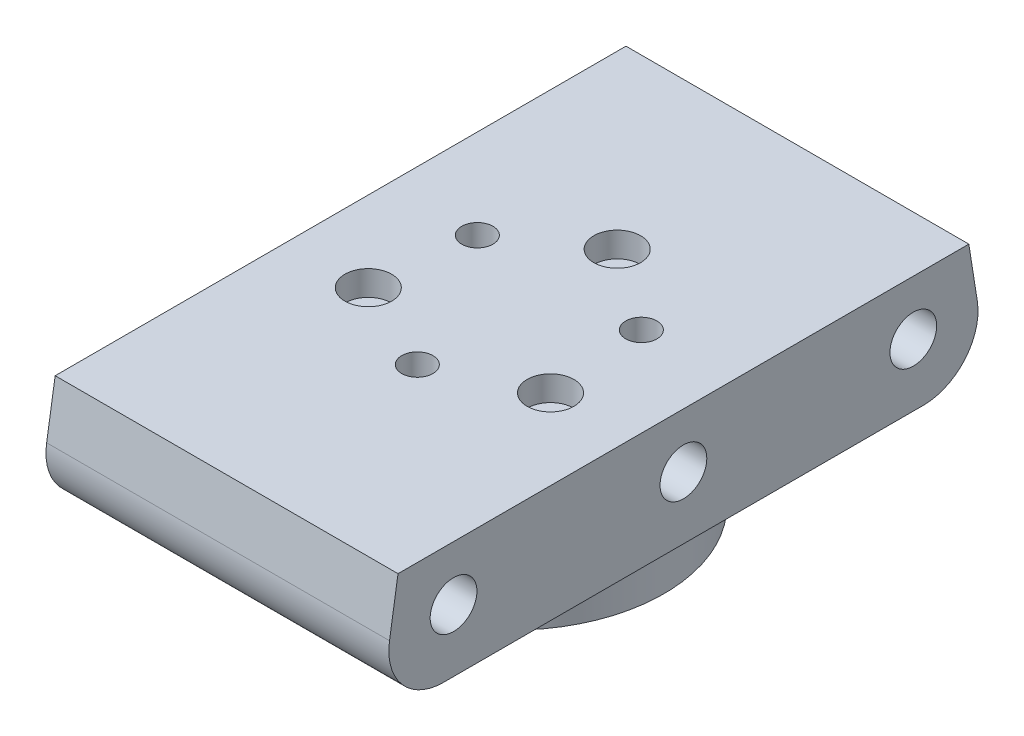
ISO-10303-21;
HEADER;
FILE_DESCRIPTION(('STEP AP214'),'2;1');
FILE_NAME('part.step','',(''),(''),'','','');
FILE_SCHEMA(('AUTOMOTIVE_DESIGN { 1 0 10303 214 1 1 1 1 }'));
ENDSEC;
DATA;
#1=APPLICATION_CONTEXT('core data for automotive mechanical design processes');
#2=APPLICATION_PROTOCOL_DEFINITION('international standard','automotive_design',2000,#1);
#3=PRODUCT_CONTEXT('',#1,'mechanical');
#4=PRODUCT('Part','Part','',(#3));
#5=PRODUCT_RELATED_PRODUCT_CATEGORY('part','',(#4));
#6=PRODUCT_DEFINITION_FORMATION('','',#4);
#7=PRODUCT_DEFINITION_CONTEXT('part definition',#1,'design');
#8=PRODUCT_DEFINITION('design','',#6,#7);
#9=PRODUCT_DEFINITION_SHAPE('','',#8);
#10=(LENGTH_UNIT() NAMED_UNIT(*) SI_UNIT(.MILLI.,.METRE.));
#11=(NAMED_UNIT(*) PLANE_ANGLE_UNIT() SI_UNIT($,.RADIAN.));
#12=(NAMED_UNIT(*) SI_UNIT($,.STERADIAN.) SOLID_ANGLE_UNIT());
#13=UNCERTAINTY_MEASURE_WITH_UNIT(LENGTH_MEASURE(1.E-05),#10,'distance_accuracy_value','');
#14=(GEOMETRIC_REPRESENTATION_CONTEXT(3) GLOBAL_UNCERTAINTY_ASSIGNED_CONTEXT((#13)) GLOBAL_UNIT_ASSIGNED_CONTEXT((#10,
#11,#12)) REPRESENTATION_CONTEXT('',''));
#15=CARTESIAN_POINT('',(0.,0.,0.));
#16=DIRECTION('',(0.,0.,1.));
#17=DIRECTION('',(1.,0.,0.));
#18=AXIS2_PLACEMENT_3D('',#15,#16,#17);
#19=CARTESIAN_POINT('',(0.,6.8,-13.5));
#20=DIRECTION('',(0.,-1.,0.));
#21=DIRECTION('',(0.,0.,-1.));
#22=AXIS2_PLACEMENT_3D('',#19,#20,#21);
#23=CYLINDRICAL_SURFACE('',#22,1.5);
#24=CARTESIAN_POINT('',(0.,0.,-13.5));
#25=DIRECTION('',(0.,1.,0.));
#26=DIRECTION('',(0.,0.,1.));
#27=AXIS2_PLACEMENT_3D('',#24,#25,#26);
#28=CIRCLE('',#27,1.5);
#29=CARTESIAN_POINT('',(0.,0.,-12.));
#30=VERTEX_POINT('',#29);
#31=EDGE_CURVE('E158',#30,#30,#28,.T.);
#32=ORIENTED_EDGE('',*,*,#31,.F.);
#33=EDGE_LOOP('',(#32));
#34=FACE_BOUND('',#33,.T.);
#35=CARTESIAN_POINT('',(0.,18.6,-13.5));
#36=DIRECTION('',(0.,1.,0.));
#37=DIRECTION('',(0.,0.,1.));
#38=AXIS2_PLACEMENT_3D('',#35,#36,#37);
#39=CIRCLE('',#38,1.5);
#40=CARTESIAN_POINT('',(0.,18.6,-12.));
#41=VERTEX_POINT('',#40);
#42=EDGE_CURVE('E41',#41,#41,#39,.T.);
#43=ORIENTED_EDGE('',*,*,#42,.T.);
#44=EDGE_LOOP('',(#43));
#45=FACE_BOUND('',#44,.T.);
#46=ADVANCED_FACE('F37',(#34,#45),#23,.F.);
#47=CARTESIAN_POINT('',(11.6913429510899,6.8,6.75));
#48=DIRECTION('',(0.,-1.,0.));
#49=DIRECTION('',(0.,0.,-1.));
#50=AXIS2_PLACEMENT_3D('',#47,#48,#49);
#51=CYLINDRICAL_SURFACE('',#50,1.5);
#52=CARTESIAN_POINT('',(11.6913429510899,0.,6.75));
#53=DIRECTION('',(0.,1.,0.));
#54=DIRECTION('',(0.,0.,1.));
#55=AXIS2_PLACEMENT_3D('',#52,#53,#54);
#56=CIRCLE('',#55,1.5);
#57=CARTESIAN_POINT('',(11.6913429510899,0.,8.25));
#58=VERTEX_POINT('',#57);
#59=EDGE_CURVE('E155',#58,#58,#56,.T.);
#60=ORIENTED_EDGE('',*,*,#59,.F.);
#61=EDGE_LOOP('',(#60));
#62=FACE_BOUND('',#61,.T.);
#63=CARTESIAN_POINT('',(11.6913429510899,18.6,6.75));
#64=DIRECTION('',(0.,1.,0.));
#65=DIRECTION('',(0.,0.,1.));
#66=AXIS2_PLACEMENT_3D('',#63,#64,#65);
#67=CIRCLE('',#66,1.5);
#68=CARTESIAN_POINT('',(11.6913429510899,18.6,8.25));
#69=VERTEX_POINT('',#68);
#70=EDGE_CURVE('E192',#69,#69,#67,.T.);
#71=ORIENTED_EDGE('',*,*,#70,.T.);
#72=EDGE_LOOP('',(#71));
#73=FACE_BOUND('',#72,.T.);
#74=ADVANCED_FACE('F249',(#62,#73),#51,.F.);
#75=CARTESIAN_POINT('',(-11.6913429510899,6.8,6.75));
#76=DIRECTION('',(0.,-1.,0.));
#77=DIRECTION('',(0.,0.,-1.));
#78=AXIS2_PLACEMENT_3D('',#75,#76,#77);
#79=CYLINDRICAL_SURFACE('',#78,1.5);
#80=CARTESIAN_POINT('',(-11.6913429510899,0.,6.75));
#81=DIRECTION('',(0.,1.,0.));
#82=DIRECTION('',(0.,0.,1.));
#83=AXIS2_PLACEMENT_3D('',#80,#81,#82);
#84=CIRCLE('',#83,1.5);
#85=CARTESIAN_POINT('',(-11.6913429510899,0.,8.25));
#86=VERTEX_POINT('',#85);
#87=EDGE_CURVE('E152',#86,#86,#84,.T.);
#88=ORIENTED_EDGE('',*,*,#87,.F.);
#89=EDGE_LOOP('',(#88));
#90=FACE_BOUND('',#89,.T.);
#91=CARTESIAN_POINT('',(-11.6913429510899,18.6,6.75));
#92=DIRECTION('',(0.,1.,0.));
#93=DIRECTION('',(0.,0.,1.));
#94=AXIS2_PLACEMENT_3D('',#91,#92,#93);
#95=CIRCLE('',#94,1.5);
#96=CARTESIAN_POINT('',(-11.6913429510899,18.6,8.25));
#97=VERTEX_POINT('',#96);
#98=EDGE_CURVE('E190',#97,#97,#95,.T.);
#99=ORIENTED_EDGE('',*,*,#98,.T.);
#100=EDGE_LOOP('',(#99));
#101=FACE_BOUND('',#100,.T.);
#102=ADVANCED_FACE('F255',(#90,#101),#79,.F.);
#103=CARTESIAN_POINT('',(0.,0.,0.));
#104=DIRECTION('',(0.,1.,0.));
#105=DIRECTION('',(0.,0.,1.));
#106=AXIS2_PLACEMENT_3D('',#103,#104,#105);
#107=PLANE('',#106);
#108=CARTESIAN_POINT('',(0.,0.,0.));
#109=DIRECTION('',(0.,1.,0.));
#110=DIRECTION('',(0.,0.,1.));
#111=AXIS2_PLACEMENT_3D('',#108,#109,#110);
#112=CIRCLE('',#111,19.5);
#113=CARTESIAN_POINT('',(0.,0.,19.5));
#114=VERTEX_POINT('',#113);
#115=EDGE_CURVE('E170',#114,#114,#112,.T.);
#116=ORIENTED_EDGE('',*,*,#115,.F.);
#117=EDGE_LOOP('',(#116));
#118=FACE_BOUND('',#117,.T.);
#119=CARTESIAN_POINT('',(-10.5222086559809,0.,-6.075));
#120=DIRECTION('',(0.,1.,0.));
#121=DIRECTION('',(0.,0.,1.));
#122=AXIS2_PLACEMENT_3D('',#119,#120,#121);
#123=CIRCLE('',#122,2.);
#124=CARTESIAN_POINT('',(-10.5222086559809,0.,-4.075));
#125=VERTEX_POINT('',#124);
#126=EDGE_CURVE('E167',#125,#125,#123,.T.);
#127=ORIENTED_EDGE('',*,*,#126,.T.);
#128=EDGE_LOOP('',(#127));
#129=FACE_BOUND('',#128,.T.);
#130=CARTESIAN_POINT('',(0.,0.,12.15));
#131=DIRECTION('',(0.,1.,0.));
#132=DIRECTION('',(0.,0.,1.));
#133=AXIS2_PLACEMENT_3D('',#130,#131,#132);
#134=CIRCLE('',#133,2.);
#135=CARTESIAN_POINT('',(0.,0.,14.15));
#136=VERTEX_POINT('',#135);
#137=EDGE_CURVE('E164',#136,#136,#134,.T.);
#138=ORIENTED_EDGE('',*,*,#137,.T.);
#139=EDGE_LOOP('',(#138));
#140=FACE_BOUND('',#139,.T.);
#141=CARTESIAN_POINT('',(10.5222086559809,0.,-6.075));
#142=DIRECTION('',(0.,1.,0.));
#143=DIRECTION('',(0.,0.,1.));
#144=AXIS2_PLACEMENT_3D('',#141,#142,#143);
#145=CIRCLE('',#144,2.);
#146=CARTESIAN_POINT('',(10.5222086559809,0.,-4.075));
#147=VERTEX_POINT('',#146);
#148=EDGE_CURVE('E161',#147,#147,#145,.T.);
#149=ORIENTED_EDGE('',*,*,#148,.T.);
#150=EDGE_LOOP('',(#149));
#151=FACE_BOUND('',#150,.T.);
#152=ORIENTED_EDGE('',*,*,#31,.T.);
#153=EDGE_LOOP('',(#152));
#154=FACE_BOUND('',#153,.T.);
#155=ORIENTED_EDGE('',*,*,#59,.T.);
#156=EDGE_LOOP('',(#155));
#157=FACE_BOUND('',#156,.T.);
#158=ORIENTED_EDGE('',*,*,#87,.T.);
#159=EDGE_LOOP('',(#158));
#160=FACE_BOUND('',#159,.T.);
#161=ADVANCED_FACE('F273',(#118,#129,#140,#151,#154,#157,#160),#107,.F.);
#162=CARTESIAN_POINT('',(0.,6.8,0.));
#163=DIRECTION('',(0.,-1.,0.));
#164=DIRECTION('',(0.,0.,-1.));
#165=AXIS2_PLACEMENT_3D('',#162,#163,#164);
#166=CYLINDRICAL_SURFACE('',#165,19.5);
#167=CARTESIAN_POINT('',(0.,4.80000000000001,0.));
#168=DIRECTION('',(0.,1.,0.));
#169=DIRECTION('',(0.,0.,1.));
#170=AXIS2_PLACEMENT_3D('',#167,#168,#169);
#171=CIRCLE('',#170,19.5);
#172=CARTESIAN_POINT('',(0.,4.80000000000001,19.5));
#173=VERTEX_POINT('',#172);
#174=EDGE_CURVE('E176',#173,#173,#171,.F.);
#175=ORIENTED_EDGE('',*,*,#174,.T.);
#176=EDGE_LOOP('',(#175));
#177=FACE_BOUND('',#176,.T.);
#178=ORIENTED_EDGE('',*,*,#115,.T.);
#179=EDGE_LOOP('',(#178));
#180=FACE_BOUND('',#179,.T.);
#181=ADVANCED_FACE('F271',(#177,#180),#166,.T.);
#182=CARTESIAN_POINT('',(-10.5222086559809,6.8,-6.075));
#183=DIRECTION('',(0.,-1.,0.));
#184=DIRECTION('',(0.,0.,-1.));
#185=AXIS2_PLACEMENT_3D('',#182,#183,#184);
#186=CYLINDRICAL_SURFACE('',#185,2.);
#187=ORIENTED_EDGE('',*,*,#126,.F.);
#188=EDGE_LOOP('',(#187));
#189=FACE_BOUND('',#188,.T.);
#190=CARTESIAN_POINT('',(-10.5222086559809,21.8,-6.075));
#191=DIRECTION('',(0.,1.,0.));
#192=DIRECTION('',(0.,0.,1.));
#193=AXIS2_PLACEMENT_3D('',#190,#191,#192);
#194=CIRCLE('',#193,2.);
#195=CARTESIAN_POINT('',(-10.5222086559809,21.8,-4.075));
#196=VERTEX_POINT('',#195);
#197=EDGE_CURVE('E198',#196,#196,#194,.T.);
#198=ORIENTED_EDGE('',*,*,#197,.T.);
#199=EDGE_LOOP('',(#198));
#200=FACE_BOUND('',#199,.T.);
#201=ADVANCED_FACE('F267',(#189,#200),#186,.F.);
#202=CARTESIAN_POINT('',(0.,6.8,12.15));
#203=DIRECTION('',(0.,-1.,0.));
#204=DIRECTION('',(0.,0.,-1.));
#205=AXIS2_PLACEMENT_3D('',#202,#203,#204);
#206=CYLINDRICAL_SURFACE('',#205,2.);
#207=ORIENTED_EDGE('',*,*,#137,.F.);
#208=EDGE_LOOP('',(#207));
#209=FACE_BOUND('',#208,.T.);
#210=CARTESIAN_POINT('',(0.,21.8,12.15));
#211=DIRECTION('',(0.,1.,0.));
#212=DIRECTION('',(0.,0.,1.));
#213=AXIS2_PLACEMENT_3D('',#210,#211,#212);
#214=CIRCLE('',#213,2.);
#215=CARTESIAN_POINT('',(0.,21.8,14.15));
#216=VERTEX_POINT('',#215);
#217=EDGE_CURVE('E202',#216,#216,#214,.T.);
#218=ORIENTED_EDGE('',*,*,#217,.T.);
#219=EDGE_LOOP('',(#218));
#220=FACE_BOUND('',#219,.T.);
#221=ADVANCED_FACE('F263',(#209,#220),#206,.F.);
#222=CARTESIAN_POINT('',(10.5222086559809,6.8,-6.075));
#223=DIRECTION('',(0.,-1.,0.));
#224=DIRECTION('',(0.,0.,-1.));
#225=AXIS2_PLACEMENT_3D('',#222,#223,#224);
#226=CYLINDRICAL_SURFACE('',#225,2.);
#227=ORIENTED_EDGE('',*,*,#148,.F.);
#228=EDGE_LOOP('',(#227));
#229=FACE_BOUND('',#228,.T.);
#230=CARTESIAN_POINT('',(10.5222086559809,21.8,-6.075));
#231=DIRECTION('',(0.,1.,0.));
#232=DIRECTION('',(0.,0.,1.));
#233=AXIS2_PLACEMENT_3D('',#230,#231,#232);
#234=CIRCLE('',#233,2.);
#235=CARTESIAN_POINT('',(10.5222086559809,21.8,-4.075));
#236=VERTEX_POINT('',#235);
#237=EDGE_CURVE('E207',#236,#236,#234,.T.);
#238=ORIENTED_EDGE('',*,*,#237,.T.);
#239=EDGE_LOOP('',(#238));
#240=FACE_BOUND('',#239,.T.);
#241=ADVANCED_FACE('F243',(#229,#240),#226,.F.);
#242=CARTESIAN_POINT('',(0.,6.8,0.));
#243=DIRECTION('',(0.,1.,0.));
#244=DIRECTION('',(0.,0.,1.));
#245=AXIS2_PLACEMENT_3D('',#242,#243,#244);
#246=PLANE('',#245);
#247=CARTESIAN_POINT('',(0.,6.8,0.));
#248=DIRECTION('',(0.,1.,0.));
#249=DIRECTION('',(0.,0.,1.));
#250=AXIS2_PLACEMENT_3D('',#247,#248,#249);
#251=CIRCLE('',#250,21.5);
#252=CARTESIAN_POINT('',(0.,6.8,21.5));
#253=VERTEX_POINT('',#252);
#254=EDGE_CURVE('E173',#253,#253,#251,.T.);
#255=ORIENTED_EDGE('',*,*,#254,.T.);
#256=EDGE_LOOP('',(#255));
#257=FACE_BOUND('',#256,.T.);
#258=DIRECTION('',(0.,0.,1.));
#259=VECTOR('',#258,1.);
#260=CARTESIAN_POINT('',(-22.,6.8,-39.));
#261=LINE('',#260,#259);
#262=CARTESIAN_POINT('',(-22.,6.8,-30.8054963273457));
#263=VERTEX_POINT('',#262);
#264=CARTESIAN_POINT('',(-22.,6.8,30.8054963273457));
#265=VERTEX_POINT('',#264);
#266=EDGE_CURVE('E150',#263,#265,#261,.T.);
#267=ORIENTED_EDGE('',*,*,#266,.F.);
#268=DIRECTION('',(-1.,0.,0.));
#269=VECTOR('',#268,1.);
#270=CARTESIAN_POINT('',(0.,6.8,-30.8054963273457));
#271=LINE('',#270,#269);
#272=CARTESIAN_POINT('',(22.,6.8,-30.8054963273457));
#273=VERTEX_POINT('',#272);
#274=EDGE_CURVE('E61',#263,#273,#271,.F.);
#275=ORIENTED_EDGE('',*,*,#274,.T.);
#276=DIRECTION('',(0.,0.,-1.));
#277=VECTOR('',#276,1.);
#278=CARTESIAN_POINT('',(22.,6.8,-39.));
#279=LINE('',#278,#277);
#280=CARTESIAN_POINT('',(22.,6.8,30.8054963273457));
#281=VERTEX_POINT('',#280);
#282=EDGE_CURVE('E113',#281,#273,#279,.T.);
#283=ORIENTED_EDGE('',*,*,#282,.F.);
#284=DIRECTION('',(1.,0.,0.));
#285=VECTOR('',#284,1.);
#286=CARTESIAN_POINT('',(0.,6.8,30.8054963273457));
#287=LINE('',#286,#285);
#288=EDGE_CURVE('E185',#281,#265,#287,.F.);
#289=ORIENTED_EDGE('',*,*,#288,.T.);
#290=EDGE_LOOP('',(#267,#275,#283,#289));
#291=FACE_BOUND('',#290,.T.);
#292=ADVANCED_FACE('F234',(#257,#291),#246,.F.);
#293=CARTESIAN_POINT('',(-22.,76.8,-39.));
#294=DIRECTION('',(1.,0.,0.));
#295=DIRECTION('',(0.,0.,-1.));
#296=AXIS2_PLACEMENT_3D('',#293,#294,#295);
#297=PLANE('',#296);
#298=CARTESIAN_POINT('',(-22.,14.8,-29.5));
#299=DIRECTION('',(-1.,0.,0.));
#300=DIRECTION('',(0.,0.,1.));
#301=AXIS2_PLACEMENT_3D('',#298,#299,#300);
#302=CIRCLE('',#301,3.);
#303=CARTESIAN_POINT('',(-22.,14.8,-26.5));
#304=VERTEX_POINT('',#303);
#305=EDGE_CURVE('E216',#304,#304,#302,.T.);
#306=ORIENTED_EDGE('',*,*,#305,.F.);
#307=EDGE_LOOP('',(#306));
#308=FACE_BOUND('',#307,.T.);
#309=CARTESIAN_POINT('',(-22.,14.8,0.));
#310=DIRECTION('',(-1.,0.,0.));
#311=DIRECTION('',(0.,0.,1.));
#312=AXIS2_PLACEMENT_3D('',#309,#310,#311);
#313=CIRCLE('',#312,3.);
#314=CARTESIAN_POINT('',(-22.,14.8,3.));
#315=VERTEX_POINT('',#314);
#316=EDGE_CURVE('E222',#315,#315,#313,.T.);
#317=ORIENTED_EDGE('',*,*,#316,.F.);
#318=EDGE_LOOP('',(#317));
#319=FACE_BOUND('',#318,.T.);
#320=CARTESIAN_POINT('',(-22.,14.8,29.5));
#321=DIRECTION('',(-1.,0.,0.));
#322=DIRECTION('',(0.,0.,1.));
#323=AXIS2_PLACEMENT_3D('',#320,#321,#322);
#324=CIRCLE('',#323,3.);
#325=CARTESIAN_POINT('',(-22.,14.8,32.5));
#326=VERTEX_POINT('',#325);
#327=EDGE_CURVE('E213',#326,#326,#324,.T.);
#328=ORIENTED_EDGE('',*,*,#327,.F.);
#329=EDGE_LOOP('',(#328));
#330=FACE_BOUND('',#329,.T.);
#331=DIRECTION('',(0.,-0.987715537065377,-0.156262656574285));
#332=VECTOR('',#331,1.);
#333=CARTESIAN_POINT('',(-22.,21.8,-36.6269079905553));
#334=LINE('',#333,#332);
#335=CARTESIAN_POINT('',(-22.,21.8,-36.6269079905553));
#336=VERTEX_POINT('',#335);
#337=CARTESIAN_POINT('',(-22.,14.89383859602,-37.7195050868033));
#338=VERTEX_POINT('',#337);
#339=EDGE_CURVE('E119',#336,#338,#334,.T.);
#340=ORIENTED_EDGE('',*,*,#339,.T.);
#341=CARTESIAN_POINT('',(-22.,13.8,-30.8054963273457));
#342=DIRECTION('',(1.,0.,0.));
#343=DIRECTION('',(0.,0.,-1.));
#344=AXIS2_PLACEMENT_3D('',#341,#342,#343);
#345=CIRCLE('',#344,7.);
#346=EDGE_CURVE('E183',#338,#263,#345,.F.);
#347=ORIENTED_EDGE('',*,*,#346,.T.);
#348=ORIENTED_EDGE('',*,*,#266,.T.);
#349=CARTESIAN_POINT('',(-22.,13.8,30.8054963273457));
#350=DIRECTION('',(1.,0.,0.));
#351=DIRECTION('',(0.,0.,-1.));
#352=AXIS2_PLACEMENT_3D('',#349,#350,#351);
#353=CIRCLE('',#352,7.);
#354=CARTESIAN_POINT('',(-22.,14.89383859602,37.7195050868033));
#355=VERTEX_POINT('',#354);
#356=EDGE_CURVE('E102',#265,#355,#353,.F.);
#357=ORIENTED_EDGE('',*,*,#356,.T.);
#358=DIRECTION('',(0.,0.987715537065378,-0.156262656574284));
#359=VECTOR('',#358,1.);
#360=CARTESIAN_POINT('',(-22.,6.8,39.));
#361=LINE('',#360,#359);
#362=CARTESIAN_POINT('',(-22.,21.8,36.6269079905553));
#363=VERTEX_POINT('',#362);
#364=EDGE_CURVE('E94',#355,#363,#361,.T.);
#365=ORIENTED_EDGE('',*,*,#364,.T.);
#366=DIRECTION('',(0.,0.,-1.));
#367=VECTOR('',#366,1.);
#368=CARTESIAN_POINT('',(-22.,21.8,36.6269079905553));
#369=LINE('',#368,#367);
#370=EDGE_CURVE('E99',#363,#336,#369,.T.);
#371=ORIENTED_EDGE('',*,*,#370,.T.);
#372=EDGE_LOOP('',(#340,#347,#348,#357,#365,#371));
#373=FACE_BOUND('',#372,.T.);
#374=ADVANCED_FACE('F97',(#308,#319,#330,#373),#297,.F.);
#375=CARTESIAN_POINT('',(22.,76.8,-39.));
#376=DIRECTION('',(-1.,0.,0.));
#377=DIRECTION('',(0.,0.,1.));
#378=AXIS2_PLACEMENT_3D('',#375,#376,#377);
#379=PLANE('',#378);
#380=CARTESIAN_POINT('',(22.,14.8,-29.5));
#381=DIRECTION('',(1.,0.,0.));
#382=DIRECTION('',(0.,0.,1.));
#383=AXIS2_PLACEMENT_3D('',#380,#381,#382);
#384=CIRCLE('',#383,3.);
#385=CARTESIAN_POINT('',(22.,14.8,-26.5));
#386=VERTEX_POINT('',#385);
#387=EDGE_CURVE('E121',#386,#386,#384,.T.);
#388=ORIENTED_EDGE('',*,*,#387,.F.);
#389=EDGE_LOOP('',(#388));
#390=FACE_BOUND('',#389,.T.);
#391=CARTESIAN_POINT('',(22.,14.8,29.5));
#392=DIRECTION('',(1.,0.,0.));
#393=DIRECTION('',(0.,0.,-1.));
#394=AXIS2_PLACEMENT_3D('',#391,#392,#393);
#395=CIRCLE('',#394,3.);
#396=CARTESIAN_POINT('',(22.,14.8,26.5));
#397=VERTEX_POINT('',#396);
#398=EDGE_CURVE('E135',#397,#397,#395,.T.);
#399=ORIENTED_EDGE('',*,*,#398,.F.);
#400=EDGE_LOOP('',(#399));
#401=FACE_BOUND('',#400,.T.);
#402=CARTESIAN_POINT('',(22.,14.8,0.));
#403=DIRECTION('',(1.,0.,0.));
#404=DIRECTION('',(0.,0.,-1.));
#405=AXIS2_PLACEMENT_3D('',#402,#403,#404);
#406=CIRCLE('',#405,3.);
#407=CARTESIAN_POINT('',(22.,14.8,-3.00000000000001));
#408=VERTEX_POINT('',#407);
#409=EDGE_CURVE('E129',#408,#408,#406,.T.);
#410=ORIENTED_EDGE('',*,*,#409,.F.);
#411=EDGE_LOOP('',(#410));
#412=FACE_BOUND('',#411,.T.);
#413=ORIENTED_EDGE('',*,*,#282,.T.);
#414=CARTESIAN_POINT('',(22.,13.8,-30.8054963273457));
#415=DIRECTION('',(-1.,0.,0.));
#416=DIRECTION('',(0.,0.,1.));
#417=AXIS2_PLACEMENT_3D('',#414,#415,#416);
#418=CIRCLE('',#417,7.);
#419=CARTESIAN_POINT('',(22.,14.89383859602,-37.7195050868033));
#420=VERTEX_POINT('',#419);
#421=EDGE_CURVE('E46',#273,#420,#418,.F.);
#422=ORIENTED_EDGE('',*,*,#421,.T.);
#423=DIRECTION('',(0.,-0.987715537065377,-0.156262656574285));
#424=VECTOR('',#423,1.);
#425=CARTESIAN_POINT('',(22.,6.80000000000001,-39.));
#426=LINE('',#425,#424);
#427=CARTESIAN_POINT('',(22.,21.8,-36.6269079905553));
#428=VERTEX_POINT('',#427);
#429=EDGE_CURVE('E144',#428,#420,#426,.T.);
#430=ORIENTED_EDGE('',*,*,#429,.F.);
#431=DIRECTION('',(0.,0.,-1.));
#432=VECTOR('',#431,1.);
#433=CARTESIAN_POINT('',(22.,21.8,36.6269079905553));
#434=LINE('',#433,#432);
#435=CARTESIAN_POINT('',(22.,21.8,36.6269079905553));
#436=VERTEX_POINT('',#435);
#437=EDGE_CURVE('E128',#436,#428,#434,.T.);
#438=ORIENTED_EDGE('',*,*,#437,.F.);
#439=DIRECTION('',(0.,0.987715537065378,-0.156262656574284));
#440=VECTOR('',#439,1.);
#441=CARTESIAN_POINT('',(22.,6.8,39.));
#442=LINE('',#441,#440);
#443=CARTESIAN_POINT('',(22.,14.89383859602,37.7195050868033));
#444=VERTEX_POINT('',#443);
#445=EDGE_CURVE('E110',#444,#436,#442,.T.);
#446=ORIENTED_EDGE('',*,*,#445,.F.);
#447=CARTESIAN_POINT('',(22.,13.8,30.8054963273457));
#448=DIRECTION('',(-1.,0.,0.));
#449=DIRECTION('',(0.,0.,1.));
#450=AXIS2_PLACEMENT_3D('',#447,#448,#449);
#451=CIRCLE('',#450,7.);
#452=EDGE_CURVE('E54',#444,#281,#451,.F.);
#453=ORIENTED_EDGE('',*,*,#452,.T.);
#454=EDGE_LOOP('',(#413,#422,#430,#438,#446,#453));
#455=FACE_BOUND('',#454,.T.);
#456=ADVANCED_FACE('F233',(#390,#401,#412,#455),#379,.F.);
#457=CARTESIAN_POINT('',(10.,21.8,36.6269079905553));
#458=DIRECTION('',(0.,-1.,0.));
#459=DIRECTION('',(0.,0.,-1.));
#460=AXIS2_PLACEMENT_3D('',#457,#458,#459);
#461=PLANE('',#460);
#462=CARTESIAN_POINT('',(0.,21.8,-13.5));
#463=DIRECTION('',(0.,1.,0.));
#464=DIRECTION('',(0.,0.,1.));
#465=AXIS2_PLACEMENT_3D('',#462,#463,#464);
#466=CIRCLE('',#465,3.);
#467=CARTESIAN_POINT('',(0.,21.8,-10.5));
#468=VERTEX_POINT('',#467);
#469=EDGE_CURVE('E320',#468,#468,#466,.T.);
#470=ORIENTED_EDGE('',*,*,#469,.F.);
#471=EDGE_LOOP('',(#470));
#472=FACE_BOUND('',#471,.T.);
#473=CARTESIAN_POINT('',(11.6913429510899,21.8,6.75000000000001));
#474=DIRECTION('',(0.,1.,0.));
#475=DIRECTION('',(0.,0.,1.));
#476=AXIS2_PLACEMENT_3D('',#473,#474,#475);
#477=CIRCLE('',#476,3.);
#478=CARTESIAN_POINT('',(11.6913429510899,21.8,9.75000000000001));
#479=VERTEX_POINT('',#478);
#480=EDGE_CURVE('E324',#479,#479,#477,.T.);
#481=ORIENTED_EDGE('',*,*,#480,.F.);
#482=EDGE_LOOP('',(#481));
#483=FACE_BOUND('',#482,.T.);
#484=CARTESIAN_POINT('',(-11.6913429510899,21.8,6.75));
#485=DIRECTION('',(0.,1.,0.));
#486=DIRECTION('',(0.,0.,1.));
#487=AXIS2_PLACEMENT_3D('',#484,#485,#486);
#488=CIRCLE('',#487,3.);
#489=CARTESIAN_POINT('',(-11.6913429510899,21.8,9.75000000000001));
#490=VERTEX_POINT('',#489);
#491=EDGE_CURVE('E328',#490,#490,#488,.T.);
#492=ORIENTED_EDGE('',*,*,#491,.F.);
#493=EDGE_LOOP('',(#492));
#494=FACE_BOUND('',#493,.T.);
#495=ORIENTED_EDGE('',*,*,#197,.F.);
#496=EDGE_LOOP('',(#495));
#497=FACE_BOUND('',#496,.T.);
#498=ORIENTED_EDGE('',*,*,#217,.F.);
#499=EDGE_LOOP('',(#498));
#500=FACE_BOUND('',#499,.T.);
#501=ORIENTED_EDGE('',*,*,#237,.F.);
#502=EDGE_LOOP('',(#501));
#503=FACE_BOUND('',#502,.T.);
#504=ORIENTED_EDGE('',*,*,#437,.T.);
#505=DIRECTION('',(1.,0.,0.));
#506=VECTOR('',#505,1.);
#507=CARTESIAN_POINT('',(10.,21.8,-36.6269079905553));
#508=LINE('',#507,#506);
#509=EDGE_CURVE('E114',#336,#428,#508,.T.);
#510=ORIENTED_EDGE('',*,*,#509,.F.);
#511=ORIENTED_EDGE('',*,*,#370,.F.);
#512=DIRECTION('',(1.,0.,0.));
#513=VECTOR('',#512,1.);
#514=CARTESIAN_POINT('',(10.,21.8,36.6269079905553));
#515=LINE('',#514,#513);
#516=EDGE_CURVE('E107',#363,#436,#515,.T.);
#517=ORIENTED_EDGE('',*,*,#516,.T.);
#518=EDGE_LOOP('',(#504,#510,#511,#517));
#519=FACE_BOUND('',#518,.T.);
#520=ADVANCED_FACE('F116',(#472,#483,#494,#497,#500,#503,#519),#461,.F.);
#521=CARTESIAN_POINT('',(10.,6.8,39.));
#522=DIRECTION('',(0.,-0.156262656574284,-0.987715537065378));
#523=DIRECTION('',(0.,0.987715537065378,-0.156262656574284));
#524=AXIS2_PLACEMENT_3D('',#521,#522,#523);
#525=PLANE('',#524);
#526=ORIENTED_EDGE('',*,*,#364,.F.);
#527=DIRECTION('',(1.,0.,0.));
#528=VECTOR('',#527,1.);
#529=CARTESIAN_POINT('',(10.,14.89383859602,37.7195050868033));
#530=LINE('',#529,#528);
#531=EDGE_CURVE('E11',#355,#444,#530,.T.);
#532=ORIENTED_EDGE('',*,*,#531,.T.);
#533=ORIENTED_EDGE('',*,*,#445,.T.);
#534=ORIENTED_EDGE('',*,*,#516,.F.);
#535=EDGE_LOOP('',(#526,#532,#533,#534));
#536=FACE_BOUND('',#535,.T.);
#537=ADVANCED_FACE('F108',(#536),#525,.F.);
#538=CARTESIAN_POINT('',(10.,6.80000000000001,-39.));
#539=DIRECTION('',(0.,-0.156262656574285,0.987715537065378));
#540=DIRECTION('',(0.,-0.987715537065378,-0.156262656574285));
#541=AXIS2_PLACEMENT_3D('',#538,#539,#540);
#542=PLANE('',#541);
#543=ORIENTED_EDGE('',*,*,#429,.T.);
#544=DIRECTION('',(-1.,0.,0.));
#545=VECTOR('',#544,1.);
#546=CARTESIAN_POINT('',(10.,14.89383859602,-37.7195050868033));
#547=LINE('',#546,#545);
#548=EDGE_CURVE('E179',#420,#338,#547,.T.);
#549=ORIENTED_EDGE('',*,*,#548,.T.);
#550=ORIENTED_EDGE('',*,*,#339,.F.);
#551=ORIENTED_EDGE('',*,*,#509,.T.);
#552=EDGE_LOOP('',(#543,#549,#550,#551));
#553=FACE_BOUND('',#552,.T.);
#554=ADVANCED_FACE('F299',(#553),#542,.F.);
#555=CARTESIAN_POINT('',(10.,14.8,0.));
#556=DIRECTION('',(1.,0.,0.));
#557=DIRECTION('',(0.,0.,-1.));
#558=AXIS2_PLACEMENT_3D('',#555,#556,#557);
#559=CYLINDRICAL_SURFACE('',#558,3.);
#560=CARTESIAN_POINT('',(10.,14.8,0.));
#561=DIRECTION('',(1.,0.,0.));
#562=DIRECTION('',(0.,0.,-1.));
#563=AXIS2_PLACEMENT_3D('',#560,#561,#562);
#564=CIRCLE('',#563,3.);
#565=CARTESIAN_POINT('',(10.,14.8,-3.00000000000001));
#566=VERTEX_POINT('',#565);
#567=EDGE_CURVE('E125',#566,#566,#564,.T.);
#568=ORIENTED_EDGE('',*,*,#567,.F.);
#569=EDGE_LOOP('',(#568));
#570=FACE_BOUND('',#569,.T.);
#571=ORIENTED_EDGE('',*,*,#409,.T.);
#572=EDGE_LOOP('',(#571));
#573=FACE_BOUND('',#572,.T.);
#574=ADVANCED_FACE('F301',(#570,#573),#559,.F.);
#575=CARTESIAN_POINT('',(10.,14.8,0.));
#576=DIRECTION('',(1.,0.,0.));
#577=DIRECTION('',(0.,0.,-1.));
#578=AXIS2_PLACEMENT_3D('',#575,#576,#577);
#579=PLANE('',#578);
#580=ORIENTED_EDGE('',*,*,#567,.T.);
#581=EDGE_LOOP('',(#580));
#582=FACE_BOUND('',#581,.T.);
#583=ADVANCED_FACE('F307',(#582),#579,.T.);
#584=CARTESIAN_POINT('',(10.,14.8,29.5));
#585=DIRECTION('',(1.,0.,0.));
#586=DIRECTION('',(0.,0.,-1.));
#587=AXIS2_PLACEMENT_3D('',#584,#585,#586);
#588=CYLINDRICAL_SURFACE('',#587,3.);
#589=CARTESIAN_POINT('',(10.,14.8,29.5));
#590=DIRECTION('',(1.,0.,0.));
#591=DIRECTION('',(0.,0.,-1.));
#592=AXIS2_PLACEMENT_3D('',#589,#590,#591);
#593=CIRCLE('',#592,3.);
#594=CARTESIAN_POINT('',(10.,14.8,26.5));
#595=VERTEX_POINT('',#594);
#596=EDGE_CURVE('E132',#595,#595,#593,.T.);
#597=ORIENTED_EDGE('',*,*,#596,.F.);
#598=EDGE_LOOP('',(#597));
#599=FACE_BOUND('',#598,.T.);
#600=ORIENTED_EDGE('',*,*,#398,.T.);
#601=EDGE_LOOP('',(#600));
#602=FACE_BOUND('',#601,.T.);
#603=ADVANCED_FACE('F399',(#599,#602),#588,.F.);
#604=CARTESIAN_POINT('',(10.,14.8,29.5));
#605=DIRECTION('',(1.,0.,0.));
#606=DIRECTION('',(0.,0.,-1.));
#607=AXIS2_PLACEMENT_3D('',#604,#605,#606);
#608=PLANE('',#607);
#609=ORIENTED_EDGE('',*,*,#596,.T.);
#610=EDGE_LOOP('',(#609));
#611=FACE_BOUND('',#610,.T.);
#612=ADVANCED_FACE('F402',(#611),#608,.T.);
#613=CARTESIAN_POINT('',(10.,14.8,-29.5));
#614=DIRECTION('',(1.,0.,0.));
#615=DIRECTION('',(0.,0.,-1.));
#616=AXIS2_PLACEMENT_3D('',#613,#614,#615);
#617=CYLINDRICAL_SURFACE('',#616,3.);
#618=CARTESIAN_POINT('',(10.,14.8,-29.5));
#619=DIRECTION('',(1.,0.,0.));
#620=DIRECTION('',(0.,0.,1.));
#621=AXIS2_PLACEMENT_3D('',#618,#619,#620);
#622=CIRCLE('',#621,3.);
#623=CARTESIAN_POINT('',(10.,14.8,-26.5));
#624=VERTEX_POINT('',#623);
#625=EDGE_CURVE('E138',#624,#624,#622,.T.);
#626=ORIENTED_EDGE('',*,*,#625,.F.);
#627=EDGE_LOOP('',(#626));
#628=FACE_BOUND('',#627,.T.);
#629=ORIENTED_EDGE('',*,*,#387,.T.);
#630=EDGE_LOOP('',(#629));
#631=FACE_BOUND('',#630,.T.);
#632=ADVANCED_FACE('F405',(#628,#631),#617,.F.);
#633=CARTESIAN_POINT('',(10.,14.8,-29.5));
#634=DIRECTION('',(-1.,0.,0.));
#635=DIRECTION('',(0.,0.,1.));
#636=AXIS2_PLACEMENT_3D('',#633,#634,#635);
#637=PLANE('',#636);
#638=ORIENTED_EDGE('',*,*,#625,.T.);
#639=EDGE_LOOP('',(#638));
#640=FACE_BOUND('',#639,.T.);
#641=ADVANCED_FACE('F396',(#640),#637,.F.);
#642=CARTESIAN_POINT('',(-10.,14.8,29.5));
#643=DIRECTION('',(-1.,0.,0.));
#644=DIRECTION('',(0.,0.,1.));
#645=AXIS2_PLACEMENT_3D('',#642,#643,#644);
#646=CYLINDRICAL_SURFACE('',#645,3.);
#647=CARTESIAN_POINT('',(-10.,14.8,29.5));
#648=DIRECTION('',(-1.,0.,0.));
#649=DIRECTION('',(0.,0.,1.));
#650=AXIS2_PLACEMENT_3D('',#647,#648,#649);
#651=CIRCLE('',#650,3.);
#652=CARTESIAN_POINT('',(-10.,14.8,32.5));
#653=VERTEX_POINT('',#652);
#654=EDGE_CURVE('E225',#653,#653,#651,.T.);
#655=ORIENTED_EDGE('',*,*,#654,.F.);
#656=EDGE_LOOP('',(#655));
#657=FACE_BOUND('',#656,.T.);
#658=ORIENTED_EDGE('',*,*,#327,.T.);
#659=EDGE_LOOP('',(#658));
#660=FACE_BOUND('',#659,.T.);
#661=ADVANCED_FACE('F230',(#657,#660),#646,.F.);
#662=CARTESIAN_POINT('',(-10.,14.8,29.5));
#663=DIRECTION('',(-1.,0.,0.));
#664=DIRECTION('',(0.,0.,1.));
#665=AXIS2_PLACEMENT_3D('',#662,#663,#664);
#666=PLANE('',#665);
#667=ORIENTED_EDGE('',*,*,#654,.T.);
#668=EDGE_LOOP('',(#667));
#669=FACE_BOUND('',#668,.T.);
#670=ADVANCED_FACE('F389',(#669),#666,.T.);
#671=CARTESIAN_POINT('',(-10.,14.8,0.));
#672=DIRECTION('',(-1.,0.,0.));
#673=DIRECTION('',(0.,0.,1.));
#674=AXIS2_PLACEMENT_3D('',#671,#672,#673);
#675=CYLINDRICAL_SURFACE('',#674,3.);
#676=CARTESIAN_POINT('',(-10.,14.8,0.));
#677=DIRECTION('',(-1.,0.,0.));
#678=DIRECTION('',(0.,0.,1.));
#679=AXIS2_PLACEMENT_3D('',#676,#677,#678);
#680=CIRCLE('',#679,3.);
#681=CARTESIAN_POINT('',(-10.,14.8,3.));
#682=VERTEX_POINT('',#681);
#683=EDGE_CURVE('E219',#682,#682,#680,.T.);
#684=ORIENTED_EDGE('',*,*,#683,.F.);
#685=EDGE_LOOP('',(#684));
#686=FACE_BOUND('',#685,.T.);
#687=ORIENTED_EDGE('',*,*,#316,.T.);
#688=EDGE_LOOP('',(#687));
#689=FACE_BOUND('',#688,.T.);
#690=ADVANCED_FACE('F385',(#686,#689),#675,.F.);
#691=CARTESIAN_POINT('',(-10.,14.8,0.));
#692=DIRECTION('',(-1.,0.,0.));
#693=DIRECTION('',(0.,0.,1.));
#694=AXIS2_PLACEMENT_3D('',#691,#692,#693);
#695=PLANE('',#694);
#696=ORIENTED_EDGE('',*,*,#683,.T.);
#697=EDGE_LOOP('',(#696));
#698=FACE_BOUND('',#697,.T.);
#699=ADVANCED_FACE('F381',(#698),#695,.T.);
#700=CARTESIAN_POINT('',(-10.,14.8,-29.5));
#701=DIRECTION('',(-1.,0.,0.));
#702=DIRECTION('',(0.,0.,1.));
#703=AXIS2_PLACEMENT_3D('',#700,#701,#702);
#704=CYLINDRICAL_SURFACE('',#703,3.);
#705=CARTESIAN_POINT('',(-10.,14.8,-29.5));
#706=DIRECTION('',(-1.,0.,0.));
#707=DIRECTION('',(0.,0.,1.));
#708=AXIS2_PLACEMENT_3D('',#705,#706,#707);
#709=CIRCLE('',#708,3.);
#710=CARTESIAN_POINT('',(-10.,14.8,-26.5));
#711=VERTEX_POINT('',#710);
#712=EDGE_CURVE('E104',#711,#711,#709,.T.);
#713=ORIENTED_EDGE('',*,*,#712,.F.);
#714=EDGE_LOOP('',(#713));
#715=FACE_BOUND('',#714,.T.);
#716=ORIENTED_EDGE('',*,*,#305,.T.);
#717=EDGE_LOOP('',(#716));
#718=FACE_BOUND('',#717,.T.);
#719=ADVANCED_FACE('F377',(#715,#718),#704,.F.);
#720=CARTESIAN_POINT('',(-10.,14.8,-29.5));
#721=DIRECTION('',(-1.,0.,0.));
#722=DIRECTION('',(0.,0.,1.));
#723=AXIS2_PLACEMENT_3D('',#720,#721,#722);
#724=PLANE('',#723);
#725=ORIENTED_EDGE('',*,*,#712,.T.);
#726=EDGE_LOOP('',(#725));
#727=FACE_BOUND('',#726,.T.);
#728=ADVANCED_FACE('F286',(#727),#724,.T.);
#729=CARTESIAN_POINT('',(0.,6.8,0.));
#730=DIRECTION('',(0.,1.,0.));
#731=DIRECTION('',(0.,0.,1.));
#732=AXIS2_PLACEMENT_3D('',#729,#730,#731);
#733=CONICAL_SURFACE('',#732,21.5,0.785398163397451);
#734=ORIENTED_EDGE('',*,*,#174,.F.);
#735=EDGE_LOOP('',(#734));
#736=FACE_BOUND('',#735,.T.);
#737=ORIENTED_EDGE('',*,*,#254,.F.);
#738=EDGE_LOOP('',(#737));
#739=FACE_BOUND('',#738,.T.);
#740=ADVANCED_FACE('F281',(#736,#739),#733,.T.);
#741=CARTESIAN_POINT('',(10.,13.8,-30.8054963273457));
#742=DIRECTION('',(-1.,0.,0.));
#743=DIRECTION('',(0.,0.,1.));
#744=AXIS2_PLACEMENT_3D('',#741,#742,#743);
#745=CYLINDRICAL_SURFACE('',#744,7.);
#746=ORIENTED_EDGE('',*,*,#421,.F.);
#747=ORIENTED_EDGE('',*,*,#274,.F.);
#748=ORIENTED_EDGE('',*,*,#346,.F.);
#749=ORIENTED_EDGE('',*,*,#548,.F.);
#750=EDGE_LOOP('',(#746,#747,#748,#749));
#751=FACE_BOUND('',#750,.T.);
#752=ADVANCED_FACE('F285',(#751),#745,.T.);
#753=CARTESIAN_POINT('',(10.,13.8,30.8054963273457));
#754=DIRECTION('',(1.,0.,0.));
#755=DIRECTION('',(0.,0.,-1.));
#756=AXIS2_PLACEMENT_3D('',#753,#754,#755);
#757=CYLINDRICAL_SURFACE('',#756,7.);
#758=ORIENTED_EDGE('',*,*,#356,.F.);
#759=ORIENTED_EDGE('',*,*,#288,.F.);
#760=ORIENTED_EDGE('',*,*,#452,.F.);
#761=ORIENTED_EDGE('',*,*,#531,.F.);
#762=EDGE_LOOP('',(#758,#759,#760,#761));
#763=FACE_BOUND('',#762,.T.);
#764=ADVANCED_FACE('F39',(#763),#757,.T.);
#765=CARTESIAN_POINT('',(-11.6913429510899,18.6,6.75));
#766=DIRECTION('',(0.,1.,0.));
#767=DIRECTION('',(0.,0.,1.));
#768=AXIS2_PLACEMENT_3D('',#765,#766,#767);
#769=CYLINDRICAL_SURFACE('',#768,3.);
#770=CARTESIAN_POINT('',(-11.6913429510899,18.6,6.75));
#771=DIRECTION('',(0.,1.,0.));
#772=DIRECTION('',(0.,0.,1.));
#773=AXIS2_PLACEMENT_3D('',#770,#771,#772);
#774=CIRCLE('',#773,3.);
#775=CARTESIAN_POINT('',(-11.6913429510899,18.6,9.75));
#776=VERTEX_POINT('',#775);
#777=EDGE_CURVE('E336',#776,#776,#774,.T.);
#778=ORIENTED_EDGE('',*,*,#777,.F.);
#779=EDGE_LOOP('',(#778));
#780=FACE_BOUND('',#779,.T.);
#781=ORIENTED_EDGE('',*,*,#491,.T.);
#782=EDGE_LOOP('',(#781));
#783=FACE_BOUND('',#782,.T.);
#784=ADVANCED_FACE('F293',(#780,#783),#769,.F.);
#785=CARTESIAN_POINT('',(-11.6913429510899,18.6,6.75));
#786=DIRECTION('',(0.,1.,0.));
#787=DIRECTION('',(0.,0.,1.));
#788=AXIS2_PLACEMENT_3D('',#785,#786,#787);
#789=PLANE('',#788);
#790=ORIENTED_EDGE('',*,*,#98,.F.);
#791=EDGE_LOOP('',(#790));
#792=FACE_BOUND('',#791,.T.);
#793=ORIENTED_EDGE('',*,*,#777,.T.);
#794=EDGE_LOOP('',(#793));
#795=FACE_BOUND('',#794,.T.);
#796=ADVANCED_FACE('F367',(#792,#795),#789,.T.);
#797=CARTESIAN_POINT('',(11.6913429510899,18.6,6.75));
#798=DIRECTION('',(0.,1.,0.));
#799=DIRECTION('',(0.,0.,1.));
#800=AXIS2_PLACEMENT_3D('',#797,#798,#799);
#801=CYLINDRICAL_SURFACE('',#800,3.);
#802=CARTESIAN_POINT('',(11.6913429510899,18.6,6.75));
#803=DIRECTION('',(0.,1.,0.));
#804=DIRECTION('',(0.,0.,1.));
#805=AXIS2_PLACEMENT_3D('',#802,#803,#804);
#806=CIRCLE('',#805,3.);
#807=CARTESIAN_POINT('',(11.6913429510899,18.6,9.75));
#808=VERTEX_POINT('',#807);
#809=EDGE_CURVE('E341',#808,#808,#806,.T.);
#810=ORIENTED_EDGE('',*,*,#809,.F.);
#811=EDGE_LOOP('',(#810));
#812=FACE_BOUND('',#811,.T.);
#813=ORIENTED_EDGE('',*,*,#480,.T.);
#814=EDGE_LOOP('',(#813));
#815=FACE_BOUND('',#814,.T.);
#816=ADVANCED_FACE('F361',(#812,#815),#801,.F.);
#817=CARTESIAN_POINT('',(11.6913429510899,18.6,6.75));
#818=DIRECTION('',(0.,1.,0.));
#819=DIRECTION('',(0.,0.,1.));
#820=AXIS2_PLACEMENT_3D('',#817,#818,#819);
#821=PLANE('',#820);
#822=ORIENTED_EDGE('',*,*,#70,.F.);
#823=EDGE_LOOP('',(#822));
#824=FACE_BOUND('',#823,.T.);
#825=ORIENTED_EDGE('',*,*,#809,.T.);
#826=EDGE_LOOP('',(#825));
#827=FACE_BOUND('',#826,.T.);
#828=ADVANCED_FACE('F353',(#824,#827),#821,.T.);
#829=CARTESIAN_POINT('',(0.,18.6,-13.5));
#830=DIRECTION('',(0.,1.,0.));
#831=DIRECTION('',(0.,0.,1.));
#832=AXIS2_PLACEMENT_3D('',#829,#830,#831);
#833=CYLINDRICAL_SURFACE('',#832,3.);
#834=CARTESIAN_POINT('',(0.,18.6,-13.5));
#835=DIRECTION('',(0.,1.,0.));
#836=DIRECTION('',(0.,0.,1.));
#837=AXIS2_PLACEMENT_3D('',#834,#835,#836);
#838=CIRCLE('',#837,3.);
#839=CARTESIAN_POINT('',(0.,18.6,-10.5));
#840=VERTEX_POINT('',#839);
#841=EDGE_CURVE('E193',#840,#840,#838,.T.);
#842=ORIENTED_EDGE('',*,*,#841,.F.);
#843=EDGE_LOOP('',(#842));
#844=FACE_BOUND('',#843,.T.);
#845=ORIENTED_EDGE('',*,*,#469,.T.);
#846=EDGE_LOOP('',(#845));
#847=FACE_BOUND('',#846,.T.);
#848=ADVANCED_FACE('F350',(#844,#847),#833,.F.);
#849=CARTESIAN_POINT('',(0.,18.6,-13.5));
#850=DIRECTION('',(0.,1.,0.));
#851=DIRECTION('',(0.,0.,1.));
#852=AXIS2_PLACEMENT_3D('',#849,#850,#851);
#853=PLANE('',#852);
#854=ORIENTED_EDGE('',*,*,#42,.F.);
#855=EDGE_LOOP('',(#854));
#856=FACE_BOUND('',#855,.T.);
#857=ORIENTED_EDGE('',*,*,#841,.T.);
#858=EDGE_LOOP('',(#857));
#859=FACE_BOUND('',#858,.T.);
#860=ADVANCED_FACE('F348',(#856,#859),#853,.T.);
#861=CLOSED_SHELL('',(#46,#74,#102,#161,#181,#201,#221,#241,#292,#374,#456,#520,#537,#554,#574,
#583,#603,#612,#632,#641,#661,#670,#690,#699,#719,#728,#740,#752,#764,#784,#796,#816,#828,#848,#860));
#862=MANIFOLD_SOLID_BREP('B2',#861);
#863=ADVANCED_BREP_SHAPE_REPRESENTATION('',(#18,#862),#14);
#864=SHAPE_DEFINITION_REPRESENTATION(#9,#863);
ENDSEC;
END-ISO-10303-21;
